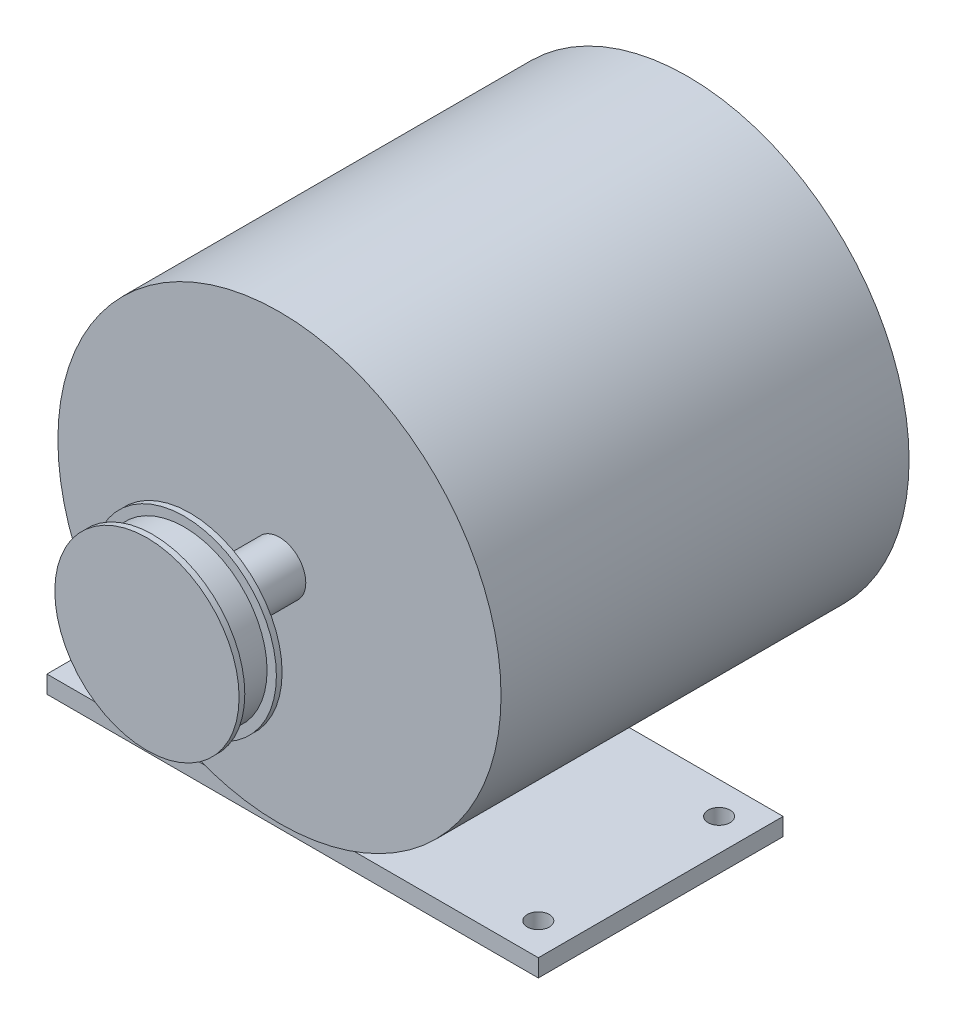
ISO-10303-21;
HEADER;
FILE_DESCRIPTION(('STEP AP214'),'2;1');
FILE_NAME('part.step','',(''),(''),'','','');
FILE_SCHEMA(('AUTOMOTIVE_DESIGN { 1 0 10303 214 1 1 1 1 }'));
ENDSEC;
DATA;
#1=APPLICATION_CONTEXT('core data for automotive mechanical design processes');
#2=APPLICATION_PROTOCOL_DEFINITION('international standard','automotive_design',2000,#1);
#3=PRODUCT_CONTEXT('',#1,'mechanical');
#4=PRODUCT('Part','Part','',(#3));
#5=PRODUCT_RELATED_PRODUCT_CATEGORY('part','',(#4));
#6=PRODUCT_DEFINITION_FORMATION('','',#4);
#7=PRODUCT_DEFINITION_CONTEXT('part definition',#1,'design');
#8=PRODUCT_DEFINITION('design','',#6,#7);
#9=PRODUCT_DEFINITION_SHAPE('','',#8);
#10=(LENGTH_UNIT() NAMED_UNIT(*) SI_UNIT(.MILLI.,.METRE.));
#11=(NAMED_UNIT(*) PLANE_ANGLE_UNIT() SI_UNIT($,.RADIAN.));
#12=(NAMED_UNIT(*) SI_UNIT($,.STERADIAN.) SOLID_ANGLE_UNIT());
#13=UNCERTAINTY_MEASURE_WITH_UNIT(LENGTH_MEASURE(1.E-05),#10,'distance_accuracy_value','');
#14=(GEOMETRIC_REPRESENTATION_CONTEXT(3) GLOBAL_UNCERTAINTY_ASSIGNED_CONTEXT((#13)) GLOBAL_UNIT_ASSIGNED_CONTEXT((#10,
#11,#12)) REPRESENTATION_CONTEXT('',''));
#15=CARTESIAN_POINT('',(0.,0.,0.));
#16=DIRECTION('',(0.,0.,1.));
#17=DIRECTION('',(1.,0.,0.));
#18=AXIS2_PLACEMENT_3D('',#15,#16,#17);
#19=CARTESIAN_POINT('',(56.,-50.5,34.2));
#20=DIRECTION('',(-1.,0.,0.));
#21=DIRECTION('',(0.,0.,1.));
#22=AXIS2_PLACEMENT_3D('',#19,#20,#21);
#23=PLANE('',#22);
#24=DIRECTION('',(0.,0.,-1.));
#25=VECTOR('',#24,1.);
#26=CARTESIAN_POINT('',(56.,-54.5,34.2));
#27=LINE('',#26,#25);
#28=CARTESIAN_POINT('',(56.,-54.5,90.));
#29=VERTEX_POINT('',#28);
#30=CARTESIAN_POINT('',(56.,-54.5,34.2));
#31=VERTEX_POINT('',#30);
#32=EDGE_CURVE('E104',#29,#31,#27,.T.);
#33=ORIENTED_EDGE('',*,*,#32,.T.);
#34=DIRECTION('',(0.,-1.,0.));
#35=VECTOR('',#34,1.);
#36=CARTESIAN_POINT('',(56.,-50.5,34.2));
#37=LINE('',#36,#35);
#38=CARTESIAN_POINT('',(56.,-50.5,34.2));
#39=VERTEX_POINT('',#38);
#40=EDGE_CURVE('E12',#39,#31,#37,.T.);
#41=ORIENTED_EDGE('',*,*,#40,.F.);
#42=DIRECTION('',(0.,0.,-1.));
#43=VECTOR('',#42,1.);
#44=CARTESIAN_POINT('',(56.,-50.5,34.2));
#45=LINE('',#44,#43);
#46=CARTESIAN_POINT('',(56.,-50.5,90.));
#47=VERTEX_POINT('',#46);
#48=EDGE_CURVE('E92',#47,#39,#45,.T.);
#49=ORIENTED_EDGE('',*,*,#48,.F.);
#50=DIRECTION('',(0.,-1.,0.));
#51=VECTOR('',#50,1.);
#52=CARTESIAN_POINT('',(56.,-50.5,90.));
#53=LINE('',#52,#51);
#54=EDGE_CURVE('E100',#47,#29,#53,.T.);
#55=ORIENTED_EDGE('',*,*,#54,.T.);
#56=EDGE_LOOP('',(#33,#41,#49,#55));
#57=FACE_BOUND('',#56,.T.);
#58=ADVANCED_FACE('F41',(#57),#23,.F.);
#59=CARTESIAN_POINT('',(-56.,-50.5,34.2));
#60=DIRECTION('',(0.,0.,1.));
#61=DIRECTION('',(1.,0.,0.));
#62=AXIS2_PLACEMENT_3D('',#59,#60,#61);
#63=PLANE('',#62);
#64=DIRECTION('',(-1.,0.,0.));
#65=VECTOR('',#64,1.);
#66=CARTESIAN_POINT('',(-56.,-54.5,34.2));
#67=LINE('',#66,#65);
#68=CARTESIAN_POINT('',(-56.,-54.5,34.2));
#69=VERTEX_POINT('',#68);
#70=EDGE_CURVE('E96',#31,#69,#67,.T.);
#71=ORIENTED_EDGE('',*,*,#70,.T.);
#72=DIRECTION('',(0.,-1.,0.));
#73=VECTOR('',#72,1.);
#74=CARTESIAN_POINT('',(-56.,-50.5,34.2));
#75=LINE('',#74,#73);
#76=CARTESIAN_POINT('',(-56.,-50.5,34.2));
#77=VERTEX_POINT('',#76);
#78=EDGE_CURVE('E49',#77,#69,#75,.T.);
#79=ORIENTED_EDGE('',*,*,#78,.F.);
#80=DIRECTION('',(-1.,0.,0.));
#81=VECTOR('',#80,1.);
#82=CARTESIAN_POINT('',(-56.,-50.5,34.2));
#83=LINE('',#82,#81);
#84=EDGE_CURVE('E87',#39,#77,#83,.T.);
#85=ORIENTED_EDGE('',*,*,#84,.F.);
#86=ORIENTED_EDGE('',*,*,#40,.T.);
#87=EDGE_LOOP('',(#71,#79,#85,#86));
#88=FACE_BOUND('',#87,.T.);
#89=ADVANCED_FACE('F95',(#88),#63,.F.);
#90=CARTESIAN_POINT('',(-56.,-50.5,34.2));
#91=DIRECTION('',(1.,0.,0.));
#92=DIRECTION('',(0.,0.,-1.));
#93=AXIS2_PLACEMENT_3D('',#90,#91,#92);
#94=PLANE('',#93);
#95=DIRECTION('',(0.,0.,1.));
#96=VECTOR('',#95,1.);
#97=CARTESIAN_POINT('',(-56.,-54.5,34.2));
#98=LINE('',#97,#96);
#99=CARTESIAN_POINT('',(-56.,-54.5,90.));
#100=VERTEX_POINT('',#99);
#101=EDGE_CURVE('E74',#69,#100,#98,.T.);
#102=ORIENTED_EDGE('',*,*,#101,.T.);
#103=DIRECTION('',(0.,-1.,0.));
#104=VECTOR('',#103,1.);
#105=CARTESIAN_POINT('',(-56.,-50.5,90.));
#106=LINE('',#105,#104);
#107=CARTESIAN_POINT('',(-56.,-50.5,90.));
#108=VERTEX_POINT('',#107);
#109=EDGE_CURVE('E97',#108,#100,#106,.T.);
#110=ORIENTED_EDGE('',*,*,#109,.F.);
#111=DIRECTION('',(0.,0.,1.));
#112=VECTOR('',#111,1.);
#113=CARTESIAN_POINT('',(-56.,-50.5,34.2));
#114=LINE('',#113,#112);
#115=EDGE_CURVE('E90',#77,#108,#114,.T.);
#116=ORIENTED_EDGE('',*,*,#115,.F.);
#117=ORIENTED_EDGE('',*,*,#78,.T.);
#118=EDGE_LOOP('',(#102,#110,#116,#117));
#119=FACE_BOUND('',#118,.T.);
#120=ADVANCED_FACE('F98',(#119),#94,.F.);
#121=CARTESIAN_POINT('',(-56.,-50.5,90.));
#122=DIRECTION('',(0.,0.,-1.));
#123=DIRECTION('',(-1.,0.,0.));
#124=AXIS2_PLACEMENT_3D('',#121,#122,#123);
#125=PLANE('',#124);
#126=DIRECTION('',(1.,0.,0.));
#127=VECTOR('',#126,1.);
#128=CARTESIAN_POINT('',(-56.,-54.5,90.));
#129=LINE('',#128,#127);
#130=EDGE_CURVE('E80',#100,#29,#129,.T.);
#131=ORIENTED_EDGE('',*,*,#130,.T.);
#132=ORIENTED_EDGE('',*,*,#54,.F.);
#133=DIRECTION('',(1.,0.,0.));
#134=VECTOR('',#133,1.);
#135=CARTESIAN_POINT('',(-56.,-50.5,90.));
#136=LINE('',#135,#134);
#137=EDGE_CURVE('E57',#108,#47,#136,.T.);
#138=ORIENTED_EDGE('',*,*,#137,.F.);
#139=ORIENTED_EDGE('',*,*,#109,.T.);
#140=EDGE_LOOP('',(#131,#132,#138,#139));
#141=FACE_BOUND('',#140,.T.);
#142=ADVANCED_FACE('F112',(#141),#125,.F.);
#143=CARTESIAN_POINT('',(0.,-50.5,0.));
#144=DIRECTION('',(0.,1.,0.));
#145=DIRECTION('',(0.,0.,1.));
#146=AXIS2_PLACEMENT_3D('',#143,#144,#145);
#147=PLANE('',#146);
#148=CARTESIAN_POINT('',(48.7,-50.5,82.7));
#149=DIRECTION('',(0.,1.,0.));
#150=DIRECTION('',(0.,0.,1.));
#151=AXIS2_PLACEMENT_3D('',#148,#149,#150);
#152=CIRCLE('',#151,2.5);
#153=CARTESIAN_POINT('',(48.7,-50.5,85.2));
#154=VERTEX_POINT('',#153);
#155=EDGE_CURVE('E136',#154,#154,#152,.F.);
#156=ORIENTED_EDGE('',*,*,#155,.T.);
#157=EDGE_LOOP('',(#156));
#158=FACE_BOUND('',#157,.T.);
#159=CARTESIAN_POINT('',(48.7,-50.5,41.5));
#160=DIRECTION('',(0.,1.,0.));
#161=DIRECTION('',(0.,0.,1.));
#162=AXIS2_PLACEMENT_3D('',#159,#160,#161);
#163=CIRCLE('',#162,2.5);
#164=CARTESIAN_POINT('',(48.7,-50.5,44.));
#165=VERTEX_POINT('',#164);
#166=EDGE_CURVE('E130',#165,#165,#163,.F.);
#167=ORIENTED_EDGE('',*,*,#166,.T.);
#168=EDGE_LOOP('',(#167));
#169=FACE_BOUND('',#168,.T.);
#170=CARTESIAN_POINT('',(-48.7,-50.5,82.7));
#171=DIRECTION('',(0.,1.,0.));
#172=DIRECTION('',(0.,0.,1.));
#173=AXIS2_PLACEMENT_3D('',#170,#171,#172);
#174=CIRCLE('',#173,2.5);
#175=CARTESIAN_POINT('',(-48.7,-50.5,85.2));
#176=VERTEX_POINT('',#175);
#177=EDGE_CURVE('E124',#176,#176,#174,.F.);
#178=ORIENTED_EDGE('',*,*,#177,.T.);
#179=EDGE_LOOP('',(#178));
#180=FACE_BOUND('',#179,.T.);
#181=CARTESIAN_POINT('',(-48.7,-50.5,41.5));
#182=DIRECTION('',(0.,1.,0.));
#183=DIRECTION('',(0.,0.,1.));
#184=AXIS2_PLACEMENT_3D('',#181,#182,#183);
#185=CIRCLE('',#184,2.5);
#186=CARTESIAN_POINT('',(-48.7,-50.5,44.));
#187=VERTEX_POINT('',#186);
#188=EDGE_CURVE('E118',#187,#187,#185,.F.);
#189=ORIENTED_EDGE('',*,*,#188,.T.);
#190=EDGE_LOOP('',(#189));
#191=FACE_BOUND('',#190,.T.);
#192=ORIENTED_EDGE('',*,*,#48,.T.);
#193=ORIENTED_EDGE('',*,*,#84,.T.);
#194=ORIENTED_EDGE('',*,*,#115,.T.);
#195=ORIENTED_EDGE('',*,*,#137,.T.);
#196=EDGE_LOOP('',(#192,#193,#194,#195));
#197=FACE_BOUND('',#196,.T.);
#198=ADVANCED_FACE('F88',(#158,#169,#180,#191,#197),#147,.T.);
#199=CARTESIAN_POINT('',(0.,-54.5,0.));
#200=DIRECTION('',(0.,1.,0.));
#201=DIRECTION('',(0.,0.,1.));
#202=AXIS2_PLACEMENT_3D('',#199,#200,#201);
#203=PLANE('',#202);
#204=CARTESIAN_POINT('',(48.7,-54.5,82.7));
#205=DIRECTION('',(0.,-1.,0.));
#206=DIRECTION('',(0.,0.,-1.));
#207=AXIS2_PLACEMENT_3D('',#204,#205,#206);
#208=CIRCLE('',#207,2.5);
#209=CARTESIAN_POINT('',(48.7,-54.5,80.2));
#210=VERTEX_POINT('',#209);
#211=EDGE_CURVE('E107',#210,#210,#208,.T.);
#212=ORIENTED_EDGE('',*,*,#211,.F.);
#213=EDGE_LOOP('',(#212));
#214=FACE_BOUND('',#213,.T.);
#215=CARTESIAN_POINT('',(48.7,-54.5,41.5));
#216=DIRECTION('',(0.,-1.,0.));
#217=DIRECTION('',(0.,0.,-1.));
#218=AXIS2_PLACEMENT_3D('',#215,#216,#217);
#219=CIRCLE('',#218,2.5);
#220=CARTESIAN_POINT('',(48.7,-54.5,39.));
#221=VERTEX_POINT('',#220);
#222=EDGE_CURVE('E133',#221,#221,#219,.T.);
#223=ORIENTED_EDGE('',*,*,#222,.F.);
#224=EDGE_LOOP('',(#223));
#225=FACE_BOUND('',#224,.T.);
#226=CARTESIAN_POINT('',(-48.7,-54.5,82.7));
#227=DIRECTION('',(0.,-1.,0.));
#228=DIRECTION('',(0.,0.,-1.));
#229=AXIS2_PLACEMENT_3D('',#226,#227,#228);
#230=CIRCLE('',#229,2.5);
#231=CARTESIAN_POINT('',(-48.7,-54.5,80.2));
#232=VERTEX_POINT('',#231);
#233=EDGE_CURVE('E127',#232,#232,#230,.T.);
#234=ORIENTED_EDGE('',*,*,#233,.F.);
#235=EDGE_LOOP('',(#234));
#236=FACE_BOUND('',#235,.T.);
#237=CARTESIAN_POINT('',(-48.7,-54.5,41.5));
#238=DIRECTION('',(0.,-1.,0.));
#239=DIRECTION('',(0.,0.,-1.));
#240=AXIS2_PLACEMENT_3D('',#237,#238,#239);
#241=CIRCLE('',#240,2.5);
#242=CARTESIAN_POINT('',(-48.7,-54.5,39.));
#243=VERTEX_POINT('',#242);
#244=EDGE_CURVE('E121',#243,#243,#241,.T.);
#245=ORIENTED_EDGE('',*,*,#244,.F.);
#246=EDGE_LOOP('',(#245));
#247=FACE_BOUND('',#246,.T.);
#248=ORIENTED_EDGE('',*,*,#32,.F.);
#249=ORIENTED_EDGE('',*,*,#130,.F.);
#250=ORIENTED_EDGE('',*,*,#101,.F.);
#251=ORIENTED_EDGE('',*,*,#70,.F.);
#252=EDGE_LOOP('',(#248,#249,#250,#251));
#253=FACE_BOUND('',#252,.T.);
#254=ADVANCED_FACE('F115',(#214,#225,#236,#247,#253),#203,.F.);
#255=CARTESIAN_POINT('',(-48.7,50.501,41.5));
#256=DIRECTION('',(0.,-1.,0.));
#257=DIRECTION('',(0.,0.,-1.));
#258=AXIS2_PLACEMENT_3D('',#255,#256,#257);
#259=CYLINDRICAL_SURFACE('',#258,2.5);
#260=ORIENTED_EDGE('',*,*,#188,.F.);
#261=EDGE_LOOP('',(#260));
#262=FACE_BOUND('',#261,.T.);
#263=ORIENTED_EDGE('',*,*,#244,.T.);
#264=EDGE_LOOP('',(#263));
#265=FACE_BOUND('',#264,.T.);
#266=ADVANCED_FACE('F146',(#262,#265),#259,.F.);
#267=CARTESIAN_POINT('',(-48.7,50.501,82.7));
#268=DIRECTION('',(0.,-1.,0.));
#269=DIRECTION('',(0.,0.,-1.));
#270=AXIS2_PLACEMENT_3D('',#267,#268,#269);
#271=CYLINDRICAL_SURFACE('',#270,2.5);
#272=ORIENTED_EDGE('',*,*,#177,.F.);
#273=EDGE_LOOP('',(#272));
#274=FACE_BOUND('',#273,.T.);
#275=ORIENTED_EDGE('',*,*,#233,.T.);
#276=EDGE_LOOP('',(#275));
#277=FACE_BOUND('',#276,.T.);
#278=ADVANCED_FACE('F155',(#274,#277),#271,.F.);
#279=CARTESIAN_POINT('',(48.7,50.501,41.5));
#280=DIRECTION('',(0.,-1.,0.));
#281=DIRECTION('',(0.,0.,-1.));
#282=AXIS2_PLACEMENT_3D('',#279,#280,#281);
#283=CYLINDRICAL_SURFACE('',#282,2.5);
#284=ORIENTED_EDGE('',*,*,#166,.F.);
#285=EDGE_LOOP('',(#284));
#286=FACE_BOUND('',#285,.T.);
#287=ORIENTED_EDGE('',*,*,#222,.T.);
#288=EDGE_LOOP('',(#287));
#289=FACE_BOUND('',#288,.T.);
#290=ADVANCED_FACE('F161',(#286,#289),#283,.F.);
#291=CARTESIAN_POINT('',(48.7,50.501,82.7));
#292=DIRECTION('',(0.,-1.,0.));
#293=DIRECTION('',(0.,0.,-1.));
#294=AXIS2_PLACEMENT_3D('',#291,#292,#293);
#295=CYLINDRICAL_SURFACE('',#294,2.5);
#296=ORIENTED_EDGE('',*,*,#155,.F.);
#297=EDGE_LOOP('',(#296));
#298=FACE_BOUND('',#297,.T.);
#299=ORIENTED_EDGE('',*,*,#211,.T.);
#300=EDGE_LOOP('',(#299));
#301=FACE_BOUND('',#300,.T.);
#302=ADVANCED_FACE('F142',(#298,#301),#295,.F.);
#303=CLOSED_SHELL('',(#58,#89,#120,#142,#198,#254,#266,#278,#290,#302));
#304=MANIFOLD_SOLID_BREP('B2',#303);
#305=CARTESIAN_POINT('',(0.,0.,113.4));
#306=DIRECTION('',(0.,0.,1.));
#307=DIRECTION('',(1.,0.,0.));
#308=AXIS2_PLACEMENT_3D('',#305,#306,#307);
#309=CYLINDRICAL_SURFACE('',#308,21.);
#310=CARTESIAN_POINT('',(0.,0.,113.4));
#311=DIRECTION('',(0.,0.,-1.));
#312=DIRECTION('',(-1.,0.,0.));
#313=AXIS2_PLACEMENT_3D('',#310,#311,#312);
#314=CIRCLE('',#313,21.);
#315=CARTESIAN_POINT('',(-21.,0.,113.4));
#316=VERTEX_POINT('',#315);
#317=EDGE_CURVE('E278',#316,#316,#314,.T.);
#318=ORIENTED_EDGE('',*,*,#317,.F.);
#319=EDGE_LOOP('',(#318));
#320=FACE_BOUND('',#319,.T.);
#321=CARTESIAN_POINT('',(0.,0.,114.7));
#322=DIRECTION('',(0.,0.,-1.));
#323=DIRECTION('',(-1.,0.,0.));
#324=AXIS2_PLACEMENT_3D('',#321,#322,#323);
#325=CIRCLE('',#324,21.);
#326=CARTESIAN_POINT('',(-21.,0.,114.7));
#327=VERTEX_POINT('',#326);
#328=EDGE_CURVE('E279',#327,#327,#325,.T.);
#329=ORIENTED_EDGE('',*,*,#328,.T.);
#330=EDGE_LOOP('',(#329));
#331=FACE_BOUND('',#330,.T.);
#332=ADVANCED_FACE('F249',(#320,#331),#309,.T.);
#333=CARTESIAN_POINT('',(0.,0.,113.4));
#334=DIRECTION('',(0.,0.,-1.));
#335=DIRECTION('',(-1.,0.,0.));
#336=AXIS2_PLACEMENT_3D('',#333,#334,#335);
#337=PLANE('',#336);
#338=CARTESIAN_POINT('',(0.,0.,113.4));
#339=DIRECTION('',(0.,0.,-1.));
#340=DIRECTION('',(-1.,0.,0.));
#341=AXIS2_PLACEMENT_3D('',#338,#339,#340);
#342=CIRCLE('',#341,12.5);
#343=CARTESIAN_POINT('',(-12.5,0.,113.4));
#344=VERTEX_POINT('',#343);
#345=EDGE_CURVE('E284',#344,#344,#342,.T.);
#346=ORIENTED_EDGE('',*,*,#345,.F.);
#347=EDGE_LOOP('',(#346));
#348=FACE_BOUND('',#347,.T.);
#349=ORIENTED_EDGE('',*,*,#317,.T.);
#350=EDGE_LOOP('',(#349));
#351=FACE_BOUND('',#350,.T.);
#352=ADVANCED_FACE('F311',(#348,#351),#337,.T.);
#353=CARTESIAN_POINT('',(0.,0.,114.7));
#354=DIRECTION('',(0.,0.,-1.));
#355=DIRECTION('',(-1.,0.,0.));
#356=AXIS2_PLACEMENT_3D('',#353,#354,#355);
#357=PLANE('',#356);
#358=CARTESIAN_POINT('',(0.,0.,114.7));
#359=DIRECTION('',(0.,0.,-1.));
#360=DIRECTION('',(-1.,0.,0.));
#361=AXIS2_PLACEMENT_3D('',#358,#359,#360);
#362=CIRCLE('',#361,18.875);
#363=CARTESIAN_POINT('',(-18.875,0.,114.7));
#364=VERTEX_POINT('',#363);
#365=EDGE_CURVE('E273',#364,#364,#362,.T.);
#366=ORIENTED_EDGE('',*,*,#365,.T.);
#367=EDGE_LOOP('',(#366));
#368=FACE_BOUND('',#367,.T.);
#369=ORIENTED_EDGE('',*,*,#328,.F.);
#370=EDGE_LOOP('',(#369));
#371=FACE_BOUND('',#370,.T.);
#372=ADVANCED_FACE('F317',(#368,#371),#357,.F.);
#373=CARTESIAN_POINT('',(0.,0.,123.2));
#374=DIRECTION('',(0.,0.,1.));
#375=DIRECTION('',(1.,0.,0.));
#376=AXIS2_PLACEMENT_3D('',#373,#374,#375);
#377=PLANE('',#376);
#378=CARTESIAN_POINT('',(0.,0.,123.2));
#379=DIRECTION('',(0.,0.,1.));
#380=DIRECTION('',(1.,0.,0.));
#381=AXIS2_PLACEMENT_3D('',#378,#379,#380);
#382=CIRCLE('',#381,21.);
#383=CARTESIAN_POINT('',(21.,0.,123.2));
#384=VERTEX_POINT('',#383);
#385=EDGE_CURVE('E270',#384,#384,#382,.T.);
#386=ORIENTED_EDGE('',*,*,#385,.T.);
#387=EDGE_LOOP('',(#386));
#388=FACE_BOUND('',#387,.T.);
#389=ADVANCED_FACE('F334',(#388),#377,.T.);
#390=CARTESIAN_POINT('',(0.,0.,121.9));
#391=DIRECTION('',(0.,0.,1.));
#392=DIRECTION('',(1.,0.,0.));
#393=AXIS2_PLACEMENT_3D('',#390,#391,#392);
#394=CYLINDRICAL_SURFACE('',#393,21.);
#395=CARTESIAN_POINT('',(0.,0.,121.9));
#396=DIRECTION('',(0.,0.,1.));
#397=DIRECTION('',(1.,0.,0.));
#398=AXIS2_PLACEMENT_3D('',#395,#396,#397);
#399=CIRCLE('',#398,21.);
#400=CARTESIAN_POINT('',(21.,0.,121.9));
#401=VERTEX_POINT('',#400);
#402=EDGE_CURVE('E269',#401,#401,#399,.T.);
#403=ORIENTED_EDGE('',*,*,#402,.T.);
#404=EDGE_LOOP('',(#403));
#405=FACE_BOUND('',#404,.T.);
#406=ORIENTED_EDGE('',*,*,#385,.F.);
#407=EDGE_LOOP('',(#406));
#408=FACE_BOUND('',#407,.T.);
#409=ADVANCED_FACE('F330',(#405,#408),#394,.T.);
#410=CARTESIAN_POINT('',(0.,0.,121.9));
#411=DIRECTION('',(0.,0.,1.));
#412=DIRECTION('',(1.,0.,0.));
#413=AXIS2_PLACEMENT_3D('',#410,#411,#412);
#414=PLANE('',#413);
#415=CARTESIAN_POINT('',(0.,0.,121.9));
#416=DIRECTION('',(0.,0.,1.));
#417=DIRECTION('',(1.,0.,0.));
#418=AXIS2_PLACEMENT_3D('',#415,#416,#417);
#419=CIRCLE('',#418,18.875);
#420=CARTESIAN_POINT('',(18.875,0.,121.9));
#421=VERTEX_POINT('',#420);
#422=EDGE_CURVE('E40',#421,#421,#419,.F.);
#423=ORIENTED_EDGE('',*,*,#422,.F.);
#424=EDGE_LOOP('',(#423));
#425=FACE_BOUND('',#424,.T.);
#426=ORIENTED_EDGE('',*,*,#402,.F.);
#427=EDGE_LOOP('',(#426));
#428=FACE_BOUND('',#427,.T.);
#429=ADVANCED_FACE('F326',(#425,#428),#414,.F.);
#430=CARTESIAN_POINT('',(0.,0.,114.7));
#431=DIRECTION('',(0.,0.,1.));
#432=DIRECTION('',(1.,0.,0.));
#433=AXIS2_PLACEMENT_3D('',#430,#431,#432);
#434=CYLINDRICAL_SURFACE('',#433,18.875);
#435=ORIENTED_EDGE('',*,*,#365,.F.);
#436=EDGE_LOOP('',(#435));
#437=FACE_BOUND('',#436,.T.);
#438=ORIENTED_EDGE('',*,*,#422,.T.);
#439=EDGE_LOOP('',(#438));
#440=FACE_BOUND('',#439,.T.);
#441=ADVANCED_FACE('F307',(#437,#440),#434,.T.);
#442=CARTESIAN_POINT('',(0.,0.,107.8));
#443=DIRECTION('',(0.,0.,1.));
#444=DIRECTION('',(1.,0.,0.));
#445=AXIS2_PLACEMENT_3D('',#442,#443,#444);
#446=CYLINDRICAL_SURFACE('',#445,12.5);
#447=CARTESIAN_POINT('',(0.,0.,107.8));
#448=DIRECTION('',(0.,0.,-1.));
#449=DIRECTION('',(-1.,0.,0.));
#450=AXIS2_PLACEMENT_3D('',#447,#448,#449);
#451=CIRCLE('',#450,12.5);
#452=CARTESIAN_POINT('',(-12.5,0.,107.8));
#453=VERTEX_POINT('',#452);
#454=EDGE_CURVE('E287',#453,#453,#451,.T.);
#455=ORIENTED_EDGE('',*,*,#454,.F.);
#456=EDGE_LOOP('',(#455));
#457=FACE_BOUND('',#456,.T.);
#458=ORIENTED_EDGE('',*,*,#345,.T.);
#459=EDGE_LOOP('',(#458));
#460=FACE_BOUND('',#459,.T.);
#461=ADVANCED_FACE('F300',(#457,#460),#446,.T.);
#462=CARTESIAN_POINT('',(0.,0.,107.8));
#463=DIRECTION('',(0.,0.,-1.));
#464=DIRECTION('',(-1.,0.,0.));
#465=AXIS2_PLACEMENT_3D('',#462,#463,#464);
#466=PLANE('',#465);
#467=CARTESIAN_POINT('',(0.,0.,107.8));
#468=DIRECTION('',(0.,0.,-1.));
#469=DIRECTION('',(-1.,0.,0.));
#470=AXIS2_PLACEMENT_3D('',#467,#468,#469);
#471=CIRCLE('',#470,6.);
#472=CARTESIAN_POINT('',(-6.,0.,107.8));
#473=VERTEX_POINT('',#472);
#474=EDGE_CURVE('E253',#473,#473,#471,.T.);
#475=ORIENTED_EDGE('',*,*,#474,.F.);
#476=EDGE_LOOP('',(#475));
#477=FACE_BOUND('',#476,.T.);
#478=ORIENTED_EDGE('',*,*,#454,.T.);
#479=EDGE_LOOP('',(#478));
#480=FACE_BOUND('',#479,.T.);
#481=ADVANCED_FACE('F297',(#477,#480),#466,.T.);
#482=CARTESIAN_POINT('',(0.,0.,0.));
#483=DIRECTION('',(0.,0.,1.));
#484=DIRECTION('',(1.,0.,0.));
#485=AXIS2_PLACEMENT_3D('',#482,#483,#484);
#486=PLANE('',#485);
#487=CARTESIAN_POINT('',(0.,0.,0.));
#488=DIRECTION('',(0.,0.,1.));
#489=DIRECTION('',(1.,0.,0.));
#490=AXIS2_PLACEMENT_3D('',#487,#488,#489);
#491=CIRCLE('',#490,50.5);
#492=CARTESIAN_POINT('',(50.5,0.,0.));
#493=VERTEX_POINT('',#492);
#494=EDGE_CURVE('E261',#493,#493,#491,.T.);
#495=ORIENTED_EDGE('',*,*,#494,.F.);
#496=EDGE_LOOP('',(#495));
#497=FACE_BOUND('',#496,.T.);
#498=ADVANCED_FACE('F299',(#497),#486,.F.);
#499=CARTESIAN_POINT('',(0.,0.,93.));
#500=DIRECTION('',(0.,0.,-1.));
#501=DIRECTION('',(-1.,0.,0.));
#502=AXIS2_PLACEMENT_3D('',#499,#500,#501);
#503=CYLINDRICAL_SURFACE('',#502,50.5);
#504=CARTESIAN_POINT('',(0.,0.,93.));
#505=DIRECTION('',(0.,0.,1.));
#506=DIRECTION('',(1.,0.,0.));
#507=AXIS2_PLACEMENT_3D('',#504,#505,#506);
#508=CIRCLE('',#507,50.5);
#509=CARTESIAN_POINT('',(50.5,0.,93.));
#510=VERTEX_POINT('',#509);
#511=EDGE_CURVE('E257',#510,#510,#508,.T.);
#512=ORIENTED_EDGE('',*,*,#511,.F.);
#513=EDGE_LOOP('',(#512));
#514=FACE_BOUND('',#513,.T.);
#515=ORIENTED_EDGE('',*,*,#494,.T.);
#516=EDGE_LOOP('',(#515));
#517=FACE_BOUND('',#516,.T.);
#518=ADVANCED_FACE('F251',(#514,#517),#503,.T.);
#519=CARTESIAN_POINT('',(0.,0.,93.));
#520=DIRECTION('',(0.,0.,1.));
#521=DIRECTION('',(1.,0.,0.));
#522=AXIS2_PLACEMENT_3D('',#519,#520,#521);
#523=PLANE('',#522);
#524=CARTESIAN_POINT('',(0.,0.,93.));
#525=DIRECTION('',(0.,0.,1.));
#526=DIRECTION('',(1.,0.,0.));
#527=AXIS2_PLACEMENT_3D('',#524,#525,#526);
#528=CIRCLE('',#527,6.);
#529=CARTESIAN_POINT('',(6.,0.,93.));
#530=VERTEX_POINT('',#529);
#531=EDGE_CURVE('E265',#530,#530,#528,.T.);
#532=ORIENTED_EDGE('',*,*,#531,.F.);
#533=EDGE_LOOP('',(#532));
#534=FACE_BOUND('',#533,.T.);
#535=ORIENTED_EDGE('',*,*,#511,.T.);
#536=EDGE_LOOP('',(#535));
#537=FACE_BOUND('',#536,.T.);
#538=ADVANCED_FACE('F341',(#534,#537),#523,.T.);
#539=CARTESIAN_POINT('',(0.,0.,123.2));
#540=DIRECTION('',(0.,0.,-1.));
#541=DIRECTION('',(-1.,0.,0.));
#542=AXIS2_PLACEMENT_3D('',#539,#540,#541);
#543=CYLINDRICAL_SURFACE('',#542,6.);
#544=ORIENTED_EDGE('',*,*,#474,.T.);
#545=EDGE_LOOP('',(#544));
#546=FACE_BOUND('',#545,.T.);
#547=ORIENTED_EDGE('',*,*,#531,.T.);
#548=EDGE_LOOP('',(#547));
#549=FACE_BOUND('',#548,.T.);
#550=ADVANCED_FACE('F294',(#546,#549),#543,.T.);
#551=CLOSED_SHELL('',(#332,#352,#372,#389,#409,#429,#441,#461,#481,#498,#518,#538,#550));
#552=MANIFOLD_SOLID_BREP('B6',#551);
#553=ADVANCED_BREP_SHAPE_REPRESENTATION('',(#18,#304,#552),#14);
#554=SHAPE_DEFINITION_REPRESENTATION(#9,#553);
ENDSEC;
END-ISO-10303-21;
